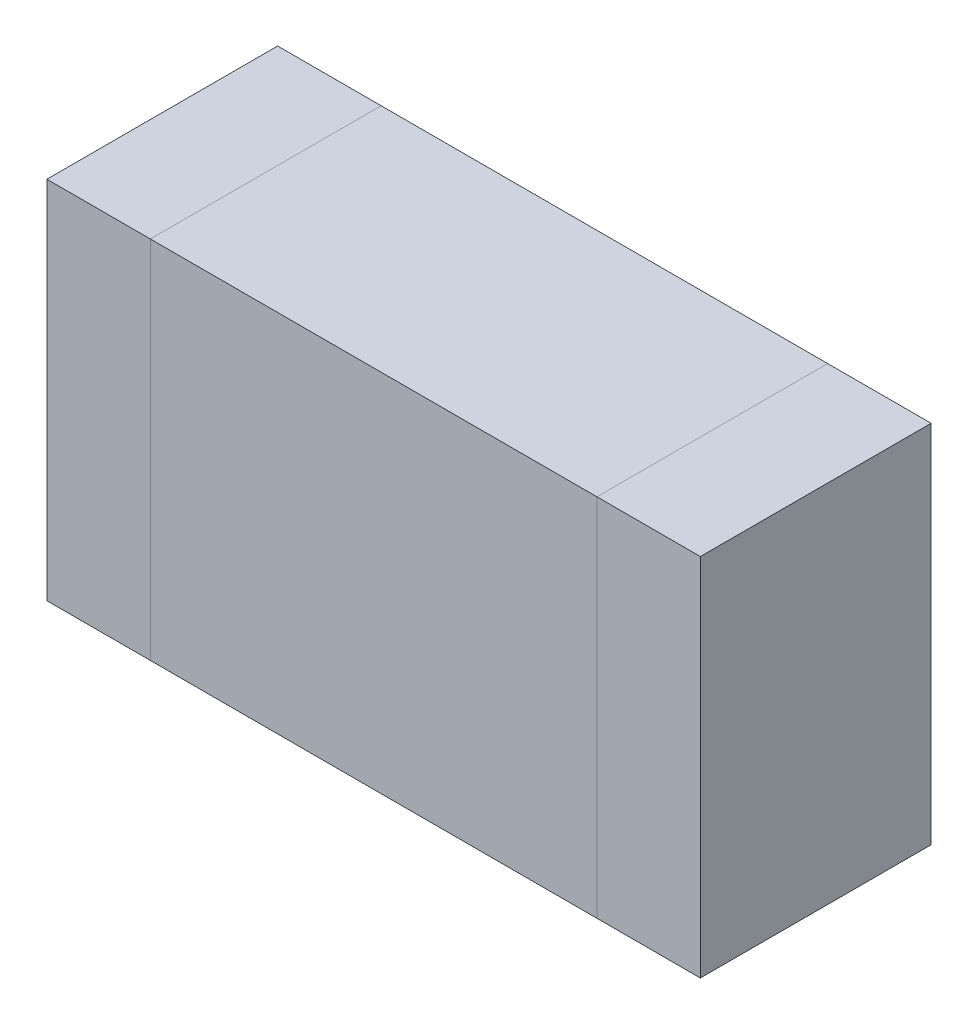
ISO-10303-21;
HEADER;
FILE_DESCRIPTION(('STEP AP214'),'2;1');
FILE_NAME('part.step','',(''),(''),'','','');
FILE_SCHEMA(('AUTOMOTIVE_DESIGN { 1 0 10303 214 1 1 1 1 }'));
ENDSEC;
DATA;
#1=APPLICATION_CONTEXT('core data for automotive mechanical design processes');
#2=APPLICATION_PROTOCOL_DEFINITION('international standard','automotive_design',2000,#1);
#3=PRODUCT_CONTEXT('',#1,'mechanical');
#4=PRODUCT('Part','Part','',(#3));
#5=PRODUCT_RELATED_PRODUCT_CATEGORY('part','',(#4));
#6=PRODUCT_DEFINITION_FORMATION('','',#4);
#7=PRODUCT_DEFINITION_CONTEXT('part definition',#1,'design');
#8=PRODUCT_DEFINITION('design','',#6,#7);
#9=PRODUCT_DEFINITION_SHAPE('','',#8);
#10=(LENGTH_UNIT() NAMED_UNIT(*) SI_UNIT(.MILLI.,.METRE.));
#11=(NAMED_UNIT(*) PLANE_ANGLE_UNIT() SI_UNIT($,.RADIAN.));
#12=(NAMED_UNIT(*) SI_UNIT($,.STERADIAN.) SOLID_ANGLE_UNIT());
#13=UNCERTAINTY_MEASURE_WITH_UNIT(LENGTH_MEASURE(1.E-05),#10,'distance_accuracy_value','');
#14=(GEOMETRIC_REPRESENTATION_CONTEXT(3) GLOBAL_UNCERTAINTY_ASSIGNED_CONTEXT((#13)) GLOBAL_UNIT_ASSIGNED_CONTEXT((#10,
#11,#12)) REPRESENTATION_CONTEXT('',''));
#15=CARTESIAN_POINT('',(0.,0.,0.));
#16=DIRECTION('',(0.,0.,1.));
#17=DIRECTION('',(1.,0.,0.));
#18=AXIS2_PLACEMENT_3D('',#15,#16,#17);
#19=CARTESIAN_POINT('',(-0.58042556,-0.4744085,0.));
#20=DIRECTION('',(-1.,0.,0.));
#21=DIRECTION('',(0.,1.,0.));
#22=AXIS2_PLACEMENT_3D('',#19,#20,#21);
#23=PLANE('',#22);
#24=DIRECTION('',(0.,0.,1.));
#25=VECTOR('',#24,1.);
#26=CARTESIAN_POINT('',(-0.58042556,-0.4744085,0.));
#27=LINE('',#26,#25);
#28=CARTESIAN_POINT('',(-0.58042556,-0.4744085,0.));
#29=VERTEX_POINT('',#28);
#30=CARTESIAN_POINT('',(-0.58042556,-0.4744085,0.5999988));
#31=VERTEX_POINT('',#30);
#32=EDGE_CURVE('P0_E11',#29,#31,#27,.T.);
#33=ORIENTED_EDGE('',*,*,#32,.T.);
#34=DIRECTION('',(0.,1.,0.));
#35=VECTOR('',#34,1.);
#36=CARTESIAN_POINT('',(-0.58042556,-0.4744085,0.5999988));
#37=LINE('',#36,#35);
#38=CARTESIAN_POINT('',(-0.58042556,0.4745736,0.5999988));
#39=VERTEX_POINT('',#38);
#40=EDGE_CURVE('P0_E24',#31,#39,#37,.T.);
#41=ORIENTED_EDGE('',*,*,#40,.T.);
#42=DIRECTION('',(0.,0.,1.));
#43=VECTOR('',#42,1.);
#44=CARTESIAN_POINT('',(-0.58042556,0.4745736,0.));
#45=LINE('',#44,#43);
#46=CARTESIAN_POINT('',(-0.58042556,0.4745736,0.));
#47=VERTEX_POINT('',#46);
#48=EDGE_CURVE('P0_E84',#47,#39,#45,.T.);
#49=ORIENTED_EDGE('',*,*,#48,.F.);
#50=DIRECTION('',(0.,1.,0.));
#51=VECTOR('',#50,1.);
#52=CARTESIAN_POINT('',(-0.58042556,-0.4744085,0.));
#53=LINE('',#52,#51);
#54=EDGE_CURVE('P0_E82',#29,#47,#53,.T.);
#55=ORIENTED_EDGE('',*,*,#54,.F.);
#56=EDGE_LOOP('',(#33,#41,#49,#55));
#57=FACE_BOUND('',#56,.T.);
#58=ADVANCED_FACE('P0_F17',(#57),#23,.T.);
#59=CARTESIAN_POINT('',(-0.58042556,0.4745736,0.));
#60=DIRECTION('',(0.,1.,0.));
#61=DIRECTION('',(1.,0.,0.));
#62=AXIS2_PLACEMENT_3D('',#59,#60,#61);
#63=PLANE('',#62);
#64=ORIENTED_EDGE('',*,*,#48,.T.);
#65=DIRECTION('',(1.,0.,0.));
#66=VECTOR('',#65,1.);
#67=CARTESIAN_POINT('',(-0.58042556,0.4745736,0.5999988));
#68=LINE('',#67,#66);
#69=CARTESIAN_POINT('',(0.58058812,0.4745736,0.5999988));
#70=VERTEX_POINT('',#69);
#71=EDGE_CURVE('P0_E80',#39,#70,#68,.T.);
#72=ORIENTED_EDGE('',*,*,#71,.T.);
#73=DIRECTION('',(0.,0.,1.));
#74=VECTOR('',#73,1.);
#75=CARTESIAN_POINT('',(0.58058812,0.4745736,0.));
#76=LINE('',#75,#74);
#77=CARTESIAN_POINT('',(0.58058812,0.4745736,0.));
#78=VERTEX_POINT('',#77);
#79=EDGE_CURVE('P0_E78',#78,#70,#76,.T.);
#80=ORIENTED_EDGE('',*,*,#79,.F.);
#81=DIRECTION('',(1.,0.,0.));
#82=VECTOR('',#81,1.);
#83=CARTESIAN_POINT('',(-0.58042556,0.4745736,0.));
#84=LINE('',#83,#82);
#85=EDGE_CURVE('P0_E59',#47,#78,#84,.T.);
#86=ORIENTED_EDGE('',*,*,#85,.F.);
#87=EDGE_LOOP('',(#64,#72,#80,#86));
#88=FACE_BOUND('',#87,.T.);
#89=ADVANCED_FACE('P0_F90',(#88),#63,.T.);
#90=CARTESIAN_POINT('',(0.58058812,0.4745736,0.));
#91=DIRECTION('',(1.,0.,0.));
#92=DIRECTION('',(0.,-1.,0.));
#93=AXIS2_PLACEMENT_3D('',#90,#91,#92);
#94=PLANE('',#93);
#95=ORIENTED_EDGE('',*,*,#79,.T.);
#96=DIRECTION('',(0.,-1.,0.));
#97=VECTOR('',#96,1.);
#98=CARTESIAN_POINT('',(0.58058812,0.4745736,0.5999988));
#99=LINE('',#98,#97);
#100=CARTESIAN_POINT('',(0.58058812,-0.4744085,0.5999988));
#101=VERTEX_POINT('',#100);
#102=EDGE_CURVE('P0_E70',#70,#101,#99,.T.);
#103=ORIENTED_EDGE('',*,*,#102,.T.);
#104=DIRECTION('',(0.,0.,1.));
#105=VECTOR('',#104,1.);
#106=CARTESIAN_POINT('',(0.58058812,-0.4744085,0.));
#107=LINE('',#106,#105);
#108=CARTESIAN_POINT('',(0.58058812,-0.4744085,0.));
#109=VERTEX_POINT('',#108);
#110=EDGE_CURVE('P0_E63',#109,#101,#107,.T.);
#111=ORIENTED_EDGE('',*,*,#110,.F.);
#112=DIRECTION('',(0.,-1.,0.));
#113=VECTOR('',#112,1.);
#114=CARTESIAN_POINT('',(0.58058812,0.4745736,0.));
#115=LINE('',#114,#113);
#116=EDGE_CURVE('P0_E54',#78,#109,#115,.T.);
#117=ORIENTED_EDGE('',*,*,#116,.F.);
#118=EDGE_LOOP('',(#95,#103,#111,#117));
#119=FACE_BOUND('',#118,.T.);
#120=ADVANCED_FACE('P0_F68',(#119),#94,.T.);
#121=CARTESIAN_POINT('',(0.58058812,-0.4744085,0.));
#122=DIRECTION('',(0.,-1.,0.));
#123=DIRECTION('',(-1.,0.,0.));
#124=AXIS2_PLACEMENT_3D('',#121,#122,#123);
#125=PLANE('',#124);
#126=ORIENTED_EDGE('',*,*,#110,.T.);
#127=DIRECTION('',(-1.,0.,0.));
#128=VECTOR('',#127,1.);
#129=CARTESIAN_POINT('',(0.58058812,-0.4744085,0.5999988));
#130=LINE('',#129,#128);
#131=EDGE_CURVE('P0_E64',#101,#31,#130,.T.);
#132=ORIENTED_EDGE('',*,*,#131,.T.);
#133=ORIENTED_EDGE('',*,*,#32,.F.);
#134=DIRECTION('',(-1.,0.,0.));
#135=VECTOR('',#134,1.);
#136=CARTESIAN_POINT('',(0.58058812,-0.4744085,0.));
#137=LINE('',#136,#135);
#138=EDGE_CURVE('P0_E58',#109,#29,#137,.T.);
#139=ORIENTED_EDGE('',*,*,#138,.F.);
#140=EDGE_LOOP('',(#126,#132,#133,#139));
#141=FACE_BOUND('',#140,.T.);
#142=ADVANCED_FACE('P0_F72',(#141),#125,.T.);
#143=CARTESIAN_POINT('',(8.12800000000526E-05,8.2549999999961E-05,0.));
#144=DIRECTION('',(0.,0.,-1.));
#145=DIRECTION('',(-1.,0.,0.));
#146=AXIS2_PLACEMENT_3D('',#143,#144,#145);
#147=PLANE('',#146);
#148=ORIENTED_EDGE('',*,*,#54,.T.);
#149=ORIENTED_EDGE('',*,*,#85,.T.);
#150=ORIENTED_EDGE('',*,*,#116,.T.);
#151=ORIENTED_EDGE('',*,*,#138,.T.);
#152=EDGE_LOOP('',(#148,#149,#150,#151));
#153=FACE_BOUND('',#152,.T.);
#154=ADVANCED_FACE('P0_F57',(#153),#147,.T.);
#155=CARTESIAN_POINT('',(8.12800000000526E-05,8.2549999999961E-05,0.5999988));
#156=DIRECTION('',(0.,0.,-1.));
#157=DIRECTION('',(-1.,0.,0.));
#158=AXIS2_PLACEMENT_3D('',#155,#156,#157);
#159=PLANE('',#158);
#160=ORIENTED_EDGE('',*,*,#131,.F.);
#161=ORIENTED_EDGE('',*,*,#102,.F.);
#162=ORIENTED_EDGE('',*,*,#71,.F.);
#163=ORIENTED_EDGE('',*,*,#40,.F.);
#164=EDGE_LOOP('',(#160,#161,#162,#163));
#165=FACE_BOUND('',#164,.T.);
#166=ADVANCED_FACE('P0_F91',(#165),#159,.F.);
#167=CLOSED_SHELL('',(#58,#89,#120,#142,#154,#166));
#168=MANIFOLD_SOLID_BREP('P0_B1',#167);
#169=CARTESIAN_POINT('',(-0.84940902,-0.4744085,0.));
#170=DIRECTION('',(-1.,0.,0.));
#171=DIRECTION('',(0.,1.,0.));
#172=AXIS2_PLACEMENT_3D('',#169,#170,#171);
#173=PLANE('',#172);
#174=DIRECTION('',(0.,0.,1.));
#175=VECTOR('',#174,1.);
#176=CARTESIAN_POINT('',(-0.84940902,-0.4744085,0.));
#177=LINE('',#176,#175);
#178=CARTESIAN_POINT('',(-0.84940902,-0.4744085,0.));
#179=VERTEX_POINT('',#178);
#180=CARTESIAN_POINT('',(-0.84940902,-0.4744085,0.5999988));
#181=VERTEX_POINT('',#180);
#182=EDGE_CURVE('P1_E11',#179,#181,#177,.T.);
#183=ORIENTED_EDGE('',*,*,#182,.T.);
#184=DIRECTION('',(0.,1.,0.));
#185=VECTOR('',#184,1.);
#186=CARTESIAN_POINT('',(-0.84940902,-0.4744085,0.5999988));
#187=LINE('',#186,#185);
#188=CARTESIAN_POINT('',(-0.84940902,0.4745736,0.5999988));
#189=VERTEX_POINT('',#188);
#190=EDGE_CURVE('P1_E24',#181,#189,#187,.T.);
#191=ORIENTED_EDGE('',*,*,#190,.T.);
#192=DIRECTION('',(0.,0.,1.));
#193=VECTOR('',#192,1.);
#194=CARTESIAN_POINT('',(-0.84940902,0.4745736,0.));
#195=LINE('',#194,#193);
#196=CARTESIAN_POINT('',(-0.84940902,0.4745736,0.));
#197=VERTEX_POINT('',#196);
#198=EDGE_CURVE('P1_E85',#197,#189,#195,.T.);
#199=ORIENTED_EDGE('',*,*,#198,.F.);
#200=DIRECTION('',(0.,1.,0.));
#201=VECTOR('',#200,1.);
#202=CARTESIAN_POINT('',(-0.84940902,-0.4744085,0.));
#203=LINE('',#202,#201);
#204=EDGE_CURVE('P1_E34',#179,#197,#203,.T.);
#205=ORIENTED_EDGE('',*,*,#204,.F.);
#206=EDGE_LOOP('',(#183,#191,#199,#205));
#207=FACE_BOUND('',#206,.T.);
#208=ADVANCED_FACE('P1_F17',(#207),#173,.T.);
#209=CARTESIAN_POINT('',(-0.84940902,0.4745736,0.));
#210=DIRECTION('',(0.,1.,0.));
#211=DIRECTION('',(1.,0.,0.));
#212=AXIS2_PLACEMENT_3D('',#209,#210,#211);
#213=PLANE('',#212);
#214=ORIENTED_EDGE('',*,*,#198,.T.);
#215=DIRECTION('',(1.,0.,0.));
#216=VECTOR('',#215,1.);
#217=CARTESIAN_POINT('',(-0.84940902,0.4745736,0.5999988));
#218=LINE('',#217,#216);
#219=CARTESIAN_POINT('',(-0.58042302,0.4745736,0.5999988));
#220=VERTEX_POINT('',#219);
#221=EDGE_CURVE('P1_E82',#189,#220,#218,.T.);
#222=ORIENTED_EDGE('',*,*,#221,.T.);
#223=DIRECTION('',(0.,0.,1.));
#224=VECTOR('',#223,1.);
#225=CARTESIAN_POINT('',(-0.58042302,0.4745736,0.));
#226=LINE('',#225,#224);
#227=CARTESIAN_POINT('',(-0.58042302,0.4745736,0.));
#228=VERTEX_POINT('',#227);
#229=EDGE_CURVE('P1_E80',#228,#220,#226,.T.);
#230=ORIENTED_EDGE('',*,*,#229,.F.);
#231=DIRECTION('',(1.,0.,0.));
#232=VECTOR('',#231,1.);
#233=CARTESIAN_POINT('',(-0.84940902,0.4745736,0.));
#234=LINE('',#233,#232);
#235=EDGE_CURVE('P1_E59',#197,#228,#234,.T.);
#236=ORIENTED_EDGE('',*,*,#235,.F.);
#237=EDGE_LOOP('',(#214,#222,#230,#236));
#238=FACE_BOUND('',#237,.T.);
#239=ADVANCED_FACE('P1_F90',(#238),#213,.T.);
#240=CARTESIAN_POINT('',(-0.58042302,0.4745736,0.));
#241=DIRECTION('',(1.,0.,0.));
#242=DIRECTION('',(0.,-1.,0.));
#243=AXIS2_PLACEMENT_3D('',#240,#241,#242);
#244=PLANE('',#243);
#245=ORIENTED_EDGE('',*,*,#229,.T.);
#246=DIRECTION('',(0.,-1.,0.));
#247=VECTOR('',#246,1.);
#248=CARTESIAN_POINT('',(-0.58042302,0.4745736,0.5999988));
#249=LINE('',#248,#247);
#250=CARTESIAN_POINT('',(-0.58042302,-0.4744085,0.5999988));
#251=VERTEX_POINT('',#250);
#252=EDGE_CURVE('P1_E69',#220,#251,#249,.T.);
#253=ORIENTED_EDGE('',*,*,#252,.T.);
#254=DIRECTION('',(0.,0.,1.));
#255=VECTOR('',#254,1.);
#256=CARTESIAN_POINT('',(-0.58042302,-0.4744085,0.));
#257=LINE('',#256,#255);
#258=CARTESIAN_POINT('',(-0.58042302,-0.4744085,0.));
#259=VERTEX_POINT('',#258);
#260=EDGE_CURVE('P1_E63',#259,#251,#257,.T.);
#261=ORIENTED_EDGE('',*,*,#260,.F.);
#262=DIRECTION('',(0.,-1.,0.));
#263=VECTOR('',#262,1.);
#264=CARTESIAN_POINT('',(-0.58042302,0.4745736,0.));
#265=LINE('',#264,#263);
#266=EDGE_CURVE('P1_E53',#228,#259,#265,.T.);
#267=ORIENTED_EDGE('',*,*,#266,.F.);
#268=EDGE_LOOP('',(#245,#253,#261,#267));
#269=FACE_BOUND('',#268,.T.);
#270=ADVANCED_FACE('P1_F67',(#269),#244,.T.);
#271=CARTESIAN_POINT('',(-0.58042302,-0.4744085,0.));
#272=DIRECTION('',(0.,-1.,0.));
#273=DIRECTION('',(-1.,0.,0.));
#274=AXIS2_PLACEMENT_3D('',#271,#272,#273);
#275=PLANE('',#274);
#276=ORIENTED_EDGE('',*,*,#260,.T.);
#277=DIRECTION('',(-1.,0.,0.));
#278=VECTOR('',#277,1.);
#279=CARTESIAN_POINT('',(-0.58042302,-0.4744085,0.5999988));
#280=LINE('',#279,#278);
#281=EDGE_CURVE('P1_E64',#251,#181,#280,.T.);
#282=ORIENTED_EDGE('',*,*,#281,.T.);
#283=ORIENTED_EDGE('',*,*,#182,.F.);
#284=DIRECTION('',(-1.,0.,0.));
#285=VECTOR('',#284,1.);
#286=CARTESIAN_POINT('',(-0.58042302,-0.4744085,0.));
#287=LINE('',#286,#285);
#288=EDGE_CURVE('P1_E57',#259,#179,#287,.T.);
#289=ORIENTED_EDGE('',*,*,#288,.F.);
#290=EDGE_LOOP('',(#276,#282,#283,#289));
#291=FACE_BOUND('',#290,.T.);
#292=ADVANCED_FACE('P1_F74',(#291),#275,.T.);
#293=CARTESIAN_POINT('',(-0.71491602,8.2549999999975E-05,0.));
#294=DIRECTION('',(0.,0.,-1.));
#295=DIRECTION('',(-1.,0.,0.));
#296=AXIS2_PLACEMENT_3D('',#293,#294,#295);
#297=PLANE('',#296);
#298=ORIENTED_EDGE('',*,*,#204,.T.);
#299=ORIENTED_EDGE('',*,*,#235,.T.);
#300=ORIENTED_EDGE('',*,*,#266,.T.);
#301=ORIENTED_EDGE('',*,*,#288,.T.);
#302=EDGE_LOOP('',(#298,#299,#300,#301));
#303=FACE_BOUND('',#302,.T.);
#304=ADVANCED_FACE('P1_F55',(#303),#297,.T.);
#305=CARTESIAN_POINT('',(-0.71491602,8.2549999999975E-05,0.5999988));
#306=DIRECTION('',(0.,0.,-1.));
#307=DIRECTION('',(-1.,0.,0.));
#308=AXIS2_PLACEMENT_3D('',#305,#306,#307);
#309=PLANE('',#308);
#310=ORIENTED_EDGE('',*,*,#281,.F.);
#311=ORIENTED_EDGE('',*,*,#252,.F.);
#312=ORIENTED_EDGE('',*,*,#221,.F.);
#313=ORIENTED_EDGE('',*,*,#190,.F.);
#314=EDGE_LOOP('',(#310,#311,#312,#313));
#315=FACE_BOUND('',#314,.T.);
#316=ADVANCED_FACE('P1_F91',(#315),#309,.F.);
#317=CLOSED_SHELL('',(#208,#239,#270,#292,#304,#316));
#318=MANIFOLD_SOLID_BREP('P1_B1',#317);
#319=CARTESIAN_POINT('',(0.58058812,-0.4744085,0.));
#320=DIRECTION('',(-1.,0.,0.));
#321=DIRECTION('',(0.,1.,0.));
#322=AXIS2_PLACEMENT_3D('',#319,#320,#321);
#323=PLANE('',#322);
#324=DIRECTION('',(0.,0.,1.));
#325=VECTOR('',#324,1.);
#326=CARTESIAN_POINT('',(0.58058812,-0.4744085,0.));
#327=LINE('',#326,#325);
#328=CARTESIAN_POINT('',(0.58058812,-0.4744085,0.));
#329=VERTEX_POINT('',#328);
#330=CARTESIAN_POINT('',(0.58058812,-0.4744085,0.5999988));
#331=VERTEX_POINT('',#330);
#332=EDGE_CURVE('P2_E10',#329,#331,#327,.T.);
#333=ORIENTED_EDGE('',*,*,#332,.T.);
#334=DIRECTION('',(0.,1.,0.));
#335=VECTOR('',#334,1.);
#336=CARTESIAN_POINT('',(0.58058812,-0.4744085,0.5999988));
#337=LINE('',#336,#335);
#338=CARTESIAN_POINT('',(0.58058812,0.4745736,0.5999988));
#339=VERTEX_POINT('',#338);
#340=EDGE_CURVE('P2_E23',#331,#339,#337,.T.);
#341=ORIENTED_EDGE('',*,*,#340,.T.);
#342=DIRECTION('',(0.,0.,1.));
#343=VECTOR('',#342,1.);
#344=CARTESIAN_POINT('',(0.58058812,0.4745736,0.));
#345=LINE('',#344,#343);
#346=CARTESIAN_POINT('',(0.58058812,0.4745736,0.));
#347=VERTEX_POINT('',#346);
#348=EDGE_CURVE('P2_E83',#347,#339,#345,.T.);
#349=ORIENTED_EDGE('',*,*,#348,.F.);
#350=DIRECTION('',(0.,1.,0.));
#351=VECTOR('',#350,1.);
#352=CARTESIAN_POINT('',(0.58058812,-0.4744085,0.));
#353=LINE('',#352,#351);
#354=EDGE_CURVE('P2_E81',#329,#347,#353,.T.);
#355=ORIENTED_EDGE('',*,*,#354,.F.);
#356=EDGE_LOOP('',(#333,#341,#349,#355));
#357=FACE_BOUND('',#356,.T.);
#358=ADVANCED_FACE('P2_F16',(#357),#323,.T.);
#359=CARTESIAN_POINT('',(0.58058812,0.4745736,0.));
#360=DIRECTION('',(0.,1.,0.));
#361=DIRECTION('',(1.,0.,0.));
#362=AXIS2_PLACEMENT_3D('',#359,#360,#361);
#363=PLANE('',#362);
#364=ORIENTED_EDGE('',*,*,#348,.T.);
#365=DIRECTION('',(1.,0.,0.));
#366=VECTOR('',#365,1.);
#367=CARTESIAN_POINT('',(0.58058812,0.4745736,0.5999988));
#368=LINE('',#367,#366);
#369=CARTESIAN_POINT('',(0.84957412,0.4745736,0.5999988));
#370=VERTEX_POINT('',#369);
#371=EDGE_CURVE('P2_E79',#339,#370,#368,.T.);
#372=ORIENTED_EDGE('',*,*,#371,.T.);
#373=DIRECTION('',(0.,0.,1.));
#374=VECTOR('',#373,1.);
#375=CARTESIAN_POINT('',(0.84957412,0.4745736,0.));
#376=LINE('',#375,#374);
#377=CARTESIAN_POINT('',(0.84957412,0.4745736,0.));
#378=VERTEX_POINT('',#377);
#379=EDGE_CURVE('P2_E77',#378,#370,#376,.T.);
#380=ORIENTED_EDGE('',*,*,#379,.F.);
#381=DIRECTION('',(1.,0.,0.));
#382=VECTOR('',#381,1.);
#383=CARTESIAN_POINT('',(0.58058812,0.4745736,0.));
#384=LINE('',#383,#382);
#385=EDGE_CURVE('P2_E57',#347,#378,#384,.T.);
#386=ORIENTED_EDGE('',*,*,#385,.F.);
#387=EDGE_LOOP('',(#364,#372,#380,#386));
#388=FACE_BOUND('',#387,.T.);
#389=ADVANCED_FACE('P2_F90',(#388),#363,.T.);
#390=CARTESIAN_POINT('',(0.84957412,0.4745736,0.));
#391=DIRECTION('',(1.,0.,0.));
#392=DIRECTION('',(0.,-1.,0.));
#393=AXIS2_PLACEMENT_3D('',#390,#391,#392);
#394=PLANE('',#393);
#395=ORIENTED_EDGE('',*,*,#379,.T.);
#396=DIRECTION('',(0.,-1.,0.));
#397=VECTOR('',#396,1.);
#398=CARTESIAN_POINT('',(0.84957412,0.4745736,0.5999988));
#399=LINE('',#398,#397);
#400=CARTESIAN_POINT('',(0.84957412,-0.4744085,0.5999988));
#401=VERTEX_POINT('',#400);
#402=EDGE_CURVE('P2_E71',#370,#401,#399,.T.);
#403=ORIENTED_EDGE('',*,*,#402,.T.);
#404=DIRECTION('',(0.,0.,1.));
#405=VECTOR('',#404,1.);
#406=CARTESIAN_POINT('',(0.84957412,-0.4744085,0.));
#407=LINE('',#406,#405);
#408=CARTESIAN_POINT('',(0.84957412,-0.4744085,0.));
#409=VERTEX_POINT('',#408);
#410=EDGE_CURVE('P2_E62',#409,#401,#407,.T.);
#411=ORIENTED_EDGE('',*,*,#410,.F.);
#412=DIRECTION('',(0.,-1.,0.));
#413=VECTOR('',#412,1.);
#414=CARTESIAN_POINT('',(0.84957412,0.4745736,0.));
#415=LINE('',#414,#413);
#416=EDGE_CURVE('P2_E53',#378,#409,#415,.T.);
#417=ORIENTED_EDGE('',*,*,#416,.F.);
#418=EDGE_LOOP('',(#395,#403,#411,#417));
#419=FACE_BOUND('',#418,.T.);
#420=ADVANCED_FACE('P2_F69',(#419),#394,.T.);
#421=CARTESIAN_POINT('',(0.84957412,-0.4744085,0.));
#422=DIRECTION('',(0.,-1.,0.));
#423=DIRECTION('',(-1.,0.,0.));
#424=AXIS2_PLACEMENT_3D('',#421,#422,#423);
#425=PLANE('',#424);
#426=ORIENTED_EDGE('',*,*,#410,.T.);
#427=DIRECTION('',(-1.,0.,0.));
#428=VECTOR('',#427,1.);
#429=CARTESIAN_POINT('',(0.84957412,-0.4744085,0.5999988));
#430=LINE('',#429,#428);
#431=EDGE_CURVE('P2_E63',#401,#331,#430,.T.);
#432=ORIENTED_EDGE('',*,*,#431,.T.);
#433=ORIENTED_EDGE('',*,*,#332,.F.);
#434=DIRECTION('',(-1.,0.,0.));
#435=VECTOR('',#434,1.);
#436=CARTESIAN_POINT('',(0.84957412,-0.4744085,0.));
#437=LINE('',#436,#435);
#438=EDGE_CURVE('P2_E55',#409,#329,#437,.T.);
#439=ORIENTED_EDGE('',*,*,#438,.F.);
#440=EDGE_LOOP('',(#426,#432,#433,#439));
#441=FACE_BOUND('',#440,.T.);
#442=ADVANCED_FACE('P2_F66',(#441),#425,.T.);
#443=CARTESIAN_POINT('',(0.71508112,8.2549999999975E-05,0.));
#444=DIRECTION('',(0.,0.,-1.));
#445=DIRECTION('',(-1.,0.,0.));
#446=AXIS2_PLACEMENT_3D('',#443,#444,#445);
#447=PLANE('',#446);
#448=ORIENTED_EDGE('',*,*,#354,.T.);
#449=ORIENTED_EDGE('',*,*,#385,.T.);
#450=ORIENTED_EDGE('',*,*,#416,.T.);
#451=ORIENTED_EDGE('',*,*,#438,.T.);
#452=EDGE_LOOP('',(#448,#449,#450,#451));
#453=FACE_BOUND('',#452,.T.);
#454=ADVANCED_FACE('P2_F54',(#453),#447,.T.);
#455=CARTESIAN_POINT('',(0.71508112,8.2549999999975E-05,0.5999988));
#456=DIRECTION('',(0.,0.,-1.));
#457=DIRECTION('',(-1.,0.,0.));
#458=AXIS2_PLACEMENT_3D('',#455,#456,#457);
#459=PLANE('',#458);
#460=ORIENTED_EDGE('',*,*,#431,.F.);
#461=ORIENTED_EDGE('',*,*,#402,.F.);
#462=ORIENTED_EDGE('',*,*,#371,.F.);
#463=ORIENTED_EDGE('',*,*,#340,.F.);
#464=EDGE_LOOP('',(#460,#461,#462,#463));
#465=FACE_BOUND('',#464,.T.);
#466=ADVANCED_FACE('P2_F88',(#465),#459,.F.);
#467=CLOSED_SHELL('',(#358,#389,#420,#442,#454,#466));
#468=MANIFOLD_SOLID_BREP('P2_B1',#467);
#469=ADVANCED_BREP_SHAPE_REPRESENTATION('',(#18,#168,#318,#468),#14);
#470=SHAPE_DEFINITION_REPRESENTATION(#9,#469);
ENDSEC;
END-ISO-10303-21;
